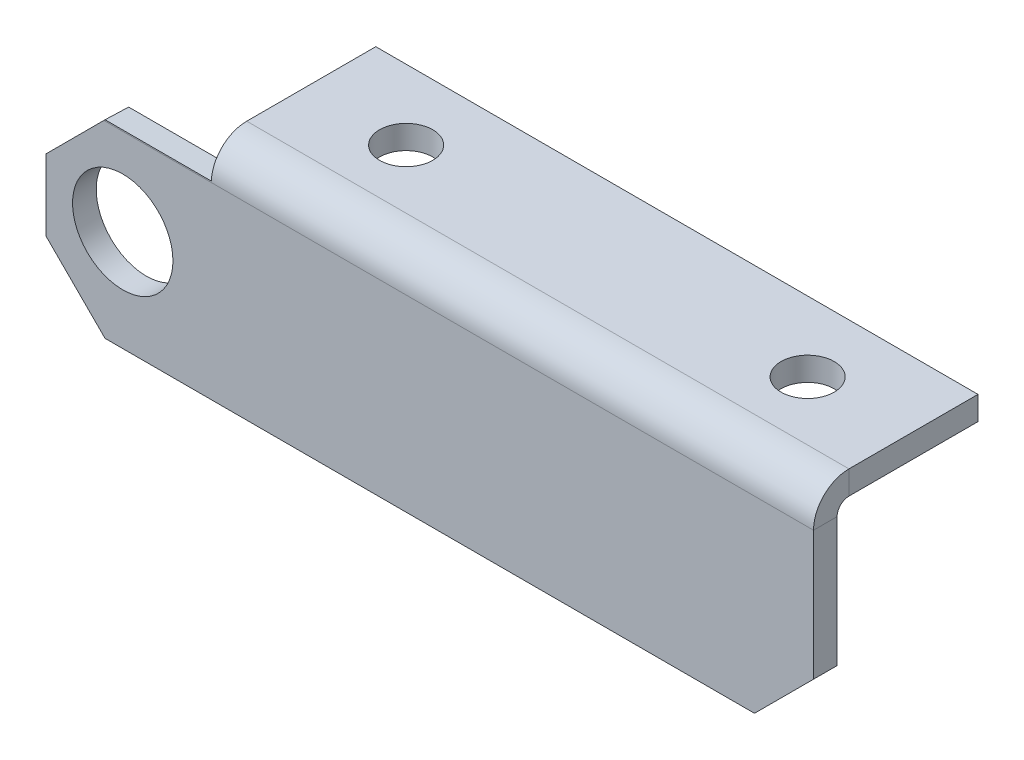
ISO-10303-21;
HEADER;
FILE_DESCRIPTION(('STEP AP214'),'2;1');
FILE_NAME('part.step','',(''),(''),'','','');
FILE_SCHEMA(('AUTOMOTIVE_DESIGN { 1 0 10303 214 1 1 1 1 }'));
ENDSEC;
DATA;
#1=APPLICATION_CONTEXT('core data for automotive mechanical design processes');
#2=APPLICATION_PROTOCOL_DEFINITION('international standard','automotive_design',2000,#1);
#3=PRODUCT_CONTEXT('',#1,'mechanical');
#4=PRODUCT('Part','Part','',(#3));
#5=PRODUCT_RELATED_PRODUCT_CATEGORY('part','',(#4));
#6=PRODUCT_DEFINITION_FORMATION('','',#4);
#7=PRODUCT_DEFINITION_CONTEXT('part definition',#1,'design');
#8=PRODUCT_DEFINITION('design','',#6,#7);
#9=PRODUCT_DEFINITION_SHAPE('','',#8);
#10=(LENGTH_UNIT() NAMED_UNIT(*) SI_UNIT(.MILLI.,.METRE.));
#11=(NAMED_UNIT(*) PLANE_ANGLE_UNIT() SI_UNIT($,.RADIAN.));
#12=(NAMED_UNIT(*) SI_UNIT($,.STERADIAN.) SOLID_ANGLE_UNIT());
#13=UNCERTAINTY_MEASURE_WITH_UNIT(LENGTH_MEASURE(1.E-05),#10,'distance_accuracy_value','');
#14=(GEOMETRIC_REPRESENTATION_CONTEXT(3) GLOBAL_UNCERTAINTY_ASSIGNED_CONTEXT((#13)) GLOBAL_UNIT_ASSIGNED_CONTEXT((#10,
#11,#12)) REPRESENTATION_CONTEXT('',''));
#15=CARTESIAN_POINT('',(0.,0.,0.));
#16=DIRECTION('',(0.,0.,1.));
#17=DIRECTION('',(1.,0.,0.));
#18=AXIS2_PLACEMENT_3D('',#15,#16,#17);
#19=CARTESIAN_POINT('',(0.,18.9292036732052,18.0707963267949));
#20=DIRECTION('',(0.,1.,0.));
#21=DIRECTION('',(1.,0.,0.));
#22=AXIS2_PLACEMENT_3D('',#19,#20,#21);
#23=PLANE('',#22);
#24=CARTESIAN_POINT('',(22.5,18.9292036732052,-6.00000000000007));
#25=DIRECTION('',(0.,-1.,0.));
#26=DIRECTION('',(0.,0.,-1.));
#27=AXIS2_PLACEMENT_3D('',#24,#25,#26);
#28=CIRCLE('',#27,2.25);
#29=CARTESIAN_POINT('',(22.5,18.9292036732052,-8.25000000000007));
#30=VERTEX_POINT('',#29);
#31=EDGE_CURVE('E475',#30,#30,#28,.T.);
#32=ORIENTED_EDGE('',*,*,#31,.T.);
#33=EDGE_LOOP('',(#32));
#34=FACE_BOUND('',#33,.T.);
#35=CARTESIAN_POINT('',(56.5000000000001,18.9292036732052,-5.99999999999995));
#36=DIRECTION('',(0.,-1.,0.));
#37=DIRECTION('',(0.,0.,-1.));
#38=AXIS2_PLACEMENT_3D('',#35,#36,#37);
#39=CIRCLE('',#38,2.25);
#40=CARTESIAN_POINT('',(56.5000000000001,18.9292036732051,-8.24999999999995));
#41=VERTEX_POINT('',#40);
#42=EDGE_CURVE('E470',#41,#41,#39,.T.);
#43=ORIENTED_EDGE('',*,*,#42,.T.);
#44=EDGE_LOOP('',(#43));
#45=FACE_BOUND('',#44,.T.);
#46=DIRECTION('',(0.,0.,1.));
#47=VECTOR('',#46,1.);
#48=CARTESIAN_POINT('',(14.,18.9292036732051,-11.9292036732051));
#49=LINE('',#48,#47);
#50=CARTESIAN_POINT('',(14.,18.9292036732051,-11.9292036732051));
#51=VERTEX_POINT('',#50);
#52=CARTESIAN_POINT('',(14.,18.9292036732051,-1.00000000000001));
#53=VERTEX_POINT('',#52);
#54=EDGE_CURVE('E198',#51,#53,#49,.T.);
#55=ORIENTED_EDGE('',*,*,#54,.T.);
#56=DIRECTION('',(1.,0.,0.));
#57=VECTOR('',#56,1.);
#58=CARTESIAN_POINT('',(0.,18.9292036732051,-1.00000000000001));
#59=LINE('',#58,#57);
#60=CARTESIAN_POINT('',(65.0000000000001,18.9292036732052,-0.99999999999989));
#61=VERTEX_POINT('',#60);
#62=EDGE_CURVE('E211',#53,#61,#59,.T.);
#63=ORIENTED_EDGE('',*,*,#62,.T.);
#64=DIRECTION('',(0.,0.,-1.));
#65=VECTOR('',#64,1.);
#66=CARTESIAN_POINT('',(65.0000000000001,18.9292036732052,18.0707963267949));
#67=LINE('',#66,#65);
#68=CARTESIAN_POINT('',(65.0000000000001,18.9292036732051,-11.929203673205));
#69=VERTEX_POINT('',#68);
#70=EDGE_CURVE('E194',#61,#69,#67,.T.);
#71=ORIENTED_EDGE('',*,*,#70,.T.);
#72=DIRECTION('',(-1.,0.,0.));
#73=VECTOR('',#72,1.);
#74=CARTESIAN_POINT('',(65.0000000000001,18.9292036732051,-11.929203673205));
#75=LINE('',#74,#73);
#76=EDGE_CURVE('E196',#69,#51,#75,.T.);
#77=ORIENTED_EDGE('',*,*,#76,.T.);
#78=EDGE_LOOP('',(#55,#63,#71,#77));
#79=FACE_BOUND('',#78,.T.);
#80=ADVANCED_FACE('F32',(#34,#45,#79),#23,.T.);
#81=CARTESIAN_POINT('',(65.0000000000001,18.9292036732052,18.0707963267949));
#82=DIRECTION('',(-1.,0.,0.));
#83=DIRECTION('',(0.,1.,0.));
#84=AXIS2_PLACEMENT_3D('',#81,#82,#83);
#85=PLANE('',#84);
#86=DIRECTION('',(0.,1.,0.));
#87=VECTOR('',#86,1.);
#88=CARTESIAN_POINT('',(65.0000000000001,18.9292036732052,-0.99999999999989));
#89=LINE('',#88,#87);
#90=CARTESIAN_POINT('',(65.,16.9292036732052,-0.999999999999918));
#91=VERTEX_POINT('',#90);
#92=EDGE_CURVE('E207',#91,#61,#89,.T.);
#93=ORIENTED_EDGE('',*,*,#92,.F.);
#94=DIRECTION('',(0.,0.,-1.));
#95=VECTOR('',#94,1.);
#96=CARTESIAN_POINT('',(65.,16.9292036732052,18.070796326795));
#97=LINE('',#96,#95);
#98=CARTESIAN_POINT('',(65.0000000000001,16.9292036732051,-11.929203673205));
#99=VERTEX_POINT('',#98);
#100=EDGE_CURVE('E188',#91,#99,#97,.T.);
#101=ORIENTED_EDGE('',*,*,#100,.T.);
#102=DIRECTION('',(0.,-1.,0.));
#103=VECTOR('',#102,1.);
#104=CARTESIAN_POINT('',(65.0000000000001,18.9292036732051,-11.929203673205));
#105=LINE('',#104,#103);
#106=EDGE_CURVE('E204',#69,#99,#105,.T.);
#107=ORIENTED_EDGE('',*,*,#106,.F.);
#108=ORIENTED_EDGE('',*,*,#70,.F.);
#109=EDGE_LOOP('',(#93,#101,#107,#108));
#110=FACE_BOUND('',#109,.T.);
#111=ADVANCED_FACE('F34',(#110),#85,.F.);
#112=CARTESIAN_POINT('',(65.0000000000001,18.9292036732051,-11.929203673205));
#113=DIRECTION('',(0.,0.,1.));
#114=DIRECTION('',(1.,0.,0.));
#115=AXIS2_PLACEMENT_3D('',#112,#113,#114);
#116=PLANE('',#115);
#117=DIRECTION('',(-1.,0.,0.));
#118=VECTOR('',#117,1.);
#119=CARTESIAN_POINT('',(65.0000000000001,16.9292036732051,-11.929203673205));
#120=LINE('',#119,#118);
#121=CARTESIAN_POINT('',(14.,16.9292036732051,-11.9292036732051));
#122=VERTEX_POINT('',#121);
#123=EDGE_CURVE('E190',#99,#122,#120,.T.);
#124=ORIENTED_EDGE('',*,*,#123,.T.);
#125=DIRECTION('',(0.,-1.,0.));
#126=VECTOR('',#125,1.);
#127=CARTESIAN_POINT('',(14.,18.9292036732051,-11.9292036732051));
#128=LINE('',#127,#126);
#129=EDGE_CURVE('E201',#51,#122,#128,.T.);
#130=ORIENTED_EDGE('',*,*,#129,.F.);
#131=ORIENTED_EDGE('',*,*,#76,.F.);
#132=ORIENTED_EDGE('',*,*,#106,.T.);
#133=EDGE_LOOP('',(#124,#130,#131,#132));
#134=FACE_BOUND('',#133,.T.);
#135=ADVANCED_FACE('F263',(#134),#116,.F.);
#136=CARTESIAN_POINT('',(14.,18.9292036732051,-11.9292036732051));
#137=DIRECTION('',(1.,0.,0.));
#138=DIRECTION('',(0.,0.,-1.));
#139=AXIS2_PLACEMENT_3D('',#136,#137,#138);
#140=PLANE('',#139);
#141=DIRECTION('',(0.,-1.,0.));
#142=VECTOR('',#141,1.);
#143=CARTESIAN_POINT('',(14.,18.9292036732051,-1.00000000000001));
#144=LINE('',#143,#142);
#145=CARTESIAN_POINT('',(14.,16.9292036732051,-1.00000000000004));
#146=VERTEX_POINT('',#145);
#147=EDGE_CURVE('E154',#53,#146,#144,.T.);
#148=ORIENTED_EDGE('',*,*,#147,.F.);
#149=ORIENTED_EDGE('',*,*,#54,.F.);
#150=ORIENTED_EDGE('',*,*,#129,.T.);
#151=DIRECTION('',(0.,0.,1.));
#152=VECTOR('',#151,1.);
#153=CARTESIAN_POINT('',(14.,16.9292036732051,-11.9292036732051));
#154=LINE('',#153,#152);
#155=EDGE_CURVE('E192',#122,#146,#154,.T.);
#156=ORIENTED_EDGE('',*,*,#155,.T.);
#157=EDGE_LOOP('',(#148,#149,#150,#156));
#158=FACE_BOUND('',#157,.T.);
#159=ADVANCED_FACE('F307',(#158),#140,.F.);
#160=CARTESIAN_POINT('',(0.,16.9292036732052,18.0707963267949));
#161=DIRECTION('',(0.,1.,0.));
#162=DIRECTION('',(1.,0.,0.));
#163=AXIS2_PLACEMENT_3D('',#160,#161,#162);
#164=PLANE('',#163);
#165=CARTESIAN_POINT('',(22.5,16.9292036732051,-6.00000000000007));
#166=DIRECTION('',(0.,-1.,0.));
#167=DIRECTION('',(0.,0.,-1.));
#168=AXIS2_PLACEMENT_3D('',#165,#166,#167);
#169=CIRCLE('',#168,2.25);
#170=CARTESIAN_POINT('',(22.5,16.9292036732051,-8.25000000000007));
#171=VERTEX_POINT('',#170);
#172=EDGE_CURVE('E479',#171,#171,#169,.T.);
#173=ORIENTED_EDGE('',*,*,#172,.F.);
#174=EDGE_LOOP('',(#173));
#175=FACE_BOUND('',#174,.T.);
#176=CARTESIAN_POINT('',(56.5000000000001,16.9292036732051,-5.99999999999998));
#177=DIRECTION('',(0.,-1.,0.));
#178=DIRECTION('',(0.,0.,-1.));
#179=AXIS2_PLACEMENT_3D('',#176,#177,#178);
#180=CIRCLE('',#179,2.25);
#181=CARTESIAN_POINT('',(56.5000000000001,16.9292036732051,-8.24999999999998));
#182=VERTEX_POINT('',#181);
#183=EDGE_CURVE('E473',#182,#182,#180,.T.);
#184=ORIENTED_EDGE('',*,*,#183,.F.);
#185=EDGE_LOOP('',(#184));
#186=FACE_BOUND('',#185,.T.);
#187=DIRECTION('',(1.,0.,0.));
#188=VECTOR('',#187,1.);
#189=CARTESIAN_POINT('',(0.,16.9292036732051,-1.));
#190=LINE('',#189,#188);
#191=EDGE_CURVE('E213',#146,#91,#190,.T.);
#192=ORIENTED_EDGE('',*,*,#191,.F.);
#193=ORIENTED_EDGE('',*,*,#155,.F.);
#194=ORIENTED_EDGE('',*,*,#123,.F.);
#195=ORIENTED_EDGE('',*,*,#100,.F.);
#196=EDGE_LOOP('',(#192,#193,#194,#195));
#197=FACE_BOUND('',#196,.T.);
#198=ADVANCED_FACE('F256',(#175,#186,#197),#164,.F.);
#199=CARTESIAN_POINT('',(0.,16.,2.));
#200=DIRECTION('',(1.,0.,0.));
#201=DIRECTION('',(0.,1.,0.));
#202=AXIS2_PLACEMENT_3D('',#199,#200,#201);
#203=PLANE('',#202);
#204=DIRECTION('',(0.,-1.,0.));
#205=VECTOR('',#204,1.);
#206=CARTESIAN_POINT('',(0.,16.,2.));
#207=LINE('',#206,#205);
#208=CARTESIAN_POINT('',(0.,11.0323083293317,2.00000000000009));
#209=VERTEX_POINT('',#208);
#210=CARTESIAN_POINT('',(0.,5.00000000000004,2.00000000000009));
#211=VERTEX_POINT('',#210);
#212=EDGE_CURVE('E172',#209,#211,#207,.T.);
#213=ORIENTED_EDGE('',*,*,#212,.F.);
#214=DIRECTION('',(0.,-0.0353907713673031,-0.999373550431483));
#215=VECTOR('',#214,1.);
#216=CARTESIAN_POINT('',(0.,10.967726692415,0.176327407268084));
#217=LINE('',#216,#215);
#218=CARTESIAN_POINT('',(0.,10.9614824177354,0.));
#219=VERTEX_POINT('',#218);
#220=EDGE_CURVE('E225',#209,#219,#217,.T.);
#221=ORIENTED_EDGE('',*,*,#220,.T.);
#222=DIRECTION('',(0.,-1.,0.));
#223=VECTOR('',#222,1.);
#224=CARTESIAN_POINT('',(0.,16.,0.));
#225=LINE('',#224,#223);
#226=CARTESIAN_POINT('',(0.,5.00000000000005,0.));
#227=VERTEX_POINT('',#226);
#228=EDGE_CURVE('E139',#219,#227,#225,.T.);
#229=ORIENTED_EDGE('',*,*,#228,.T.);
#230=DIRECTION('',(0.,0.,1.));
#231=VECTOR('',#230,1.);
#232=CARTESIAN_POINT('',(0.,5.00000000000006,2.00000000000009));
#233=LINE('',#232,#231);
#234=EDGE_CURVE('E223',#227,#211,#233,.T.);
#235=ORIENTED_EDGE('',*,*,#234,.T.);
#236=EDGE_LOOP('',(#213,#221,#229,#235));
#237=FACE_BOUND('',#236,.T.);
#238=ADVANCED_FACE('F279',(#237),#203,.F.);
#239=CARTESIAN_POINT('',(65.0000000000001,0.,2.));
#240=DIRECTION('',(-1.,0.,0.));
#241=DIRECTION('',(0.,0.,1.));
#242=AXIS2_PLACEMENT_3D('',#239,#240,#241);
#243=PLANE('',#242);
#244=DIRECTION('',(0.,1.,0.));
#245=VECTOR('',#244,1.);
#246=CARTESIAN_POINT('',(65.0000000000001,0.,2.));
#247=LINE('',#246,#245);
#248=CARTESIAN_POINT('',(65.0000000000001,5.00000000000001,2.));
#249=VERTEX_POINT('',#248);
#250=CARTESIAN_POINT('',(65.0000000000001,15.9292036732051,2.00000000000009));
#251=VERTEX_POINT('',#250);
#252=EDGE_CURVE('E177',#249,#251,#247,.T.);
#253=ORIENTED_EDGE('',*,*,#252,.F.);
#254=DIRECTION('',(0.,0.,-1.));
#255=VECTOR('',#254,1.);
#256=CARTESIAN_POINT('',(65.0000000000001,5.00000000000001,2.));
#257=LINE('',#256,#255);
#258=CARTESIAN_POINT('',(65.0000000000001,5.,0.));
#259=VERTEX_POINT('',#258);
#260=EDGE_CURVE('E235',#249,#259,#257,.T.);
#261=ORIENTED_EDGE('',*,*,#260,.T.);
#262=DIRECTION('',(0.,1.,0.));
#263=VECTOR('',#262,1.);
#264=CARTESIAN_POINT('',(65.0000000000001,0.,0.));
#265=LINE('',#264,#263);
#266=CARTESIAN_POINT('',(65.0000000000001,15.9292036732052,0.));
#267=VERTEX_POINT('',#266);
#268=EDGE_CURVE('E170',#259,#267,#265,.T.);
#269=ORIENTED_EDGE('',*,*,#268,.T.);
#270=DIRECTION('',(0.,0.,1.));
#271=VECTOR('',#270,1.);
#272=CARTESIAN_POINT('',(65.0000000000001,15.9292036732051,2.00000000000009));
#273=LINE('',#272,#271);
#274=EDGE_CURVE('E182',#267,#251,#273,.T.);
#275=ORIENTED_EDGE('',*,*,#274,.T.);
#276=EDGE_LOOP('',(#253,#261,#269,#275));
#277=FACE_BOUND('',#276,.T.);
#278=ADVANCED_FACE('F241',(#277),#243,.F.);
#279=CARTESIAN_POINT('',(0.,0.,0.));
#280=DIRECTION('',(0.,0.,1.));
#281=DIRECTION('',(1.,0.,0.));
#282=AXIS2_PLACEMENT_3D('',#279,#280,#281);
#283=PLANE('',#282);
#284=CARTESIAN_POINT('',(6.50000000000001,8.5592036732051,0.));
#285=DIRECTION('',(0.,0.,1.));
#286=DIRECTION('',(1.,0.,0.));
#287=AXIS2_PLACEMENT_3D('',#284,#285,#286);
#288=CIRCLE('',#287,4.25);
#289=CARTESIAN_POINT('',(10.75,8.5592036732051,0.));
#290=VERTEX_POINT('',#289);
#291=EDGE_CURVE('E150',#290,#290,#288,.T.);
#292=ORIENTED_EDGE('',*,*,#291,.T.);
#293=EDGE_LOOP('',(#292));
#294=FACE_BOUND('',#293,.T.);
#295=ORIENTED_EDGE('',*,*,#268,.F.);
#296=DIRECTION('',(0.707106781186549,0.707106781186547,0.));
#297=VECTOR('',#296,1.);
#298=CARTESIAN_POINT('',(65.0000000000001,5.00000000000001,0.));
#299=LINE('',#298,#297);
#300=CARTESIAN_POINT('',(60.0000000000001,0.,0.));
#301=VERTEX_POINT('',#300);
#302=EDGE_CURVE('E54',#259,#301,#299,.F.);
#303=ORIENTED_EDGE('',*,*,#302,.T.);
#304=DIRECTION('',(1.,0.,0.));
#305=VECTOR('',#304,1.);
#306=CARTESIAN_POINT('',(0.,0.,0.));
#307=LINE('',#306,#305);
#308=CARTESIAN_POINT('',(5.00000000000009,0.,0.));
#309=VERTEX_POINT('',#308);
#310=EDGE_CURVE('E168',#309,#301,#307,.T.);
#311=ORIENTED_EDGE('',*,*,#310,.F.);
#312=DIRECTION('',(0.707106781186552,-0.707106781186544,0.));
#313=VECTOR('',#312,1.);
#314=CARTESIAN_POINT('',(5.00000000000009,0.,0.));
#315=LINE('',#314,#313);
#316=EDGE_CURVE('E227',#309,#227,#315,.F.);
#317=ORIENTED_EDGE('',*,*,#316,.T.);
#318=ORIENTED_EDGE('',*,*,#228,.F.);
#319=DIRECTION('',(0.706885193723847,0.707328299231693,0.));
#320=VECTOR('',#319,1.);
#321=CARTESIAN_POINT('',(5.01768428999612,15.9823120042595,0.));
#322=LINE('',#321,#320);
#323=CARTESIAN_POINT('',(4.96460922863278,15.9292036732051,0.));
#324=VERTEX_POINT('',#323);
#325=EDGE_CURVE('E229',#219,#324,#322,.T.);
#326=ORIENTED_EDGE('',*,*,#325,.T.);
#327=DIRECTION('',(1.,0.,0.));
#328=VECTOR('',#327,1.);
#329=CARTESIAN_POINT('',(0.,15.9292036732051,0.));
#330=LINE('',#329,#328);
#331=EDGE_CURVE('E179',#324,#267,#330,.T.);
#332=ORIENTED_EDGE('',*,*,#331,.T.);
#333=EDGE_LOOP('',(#295,#303,#311,#317,#318,#326,#332));
#334=FACE_BOUND('',#333,.T.);
#335=ADVANCED_FACE('F244',(#294,#334),#283,.F.);
#336=CARTESIAN_POINT('',(0.,0.,2.));
#337=DIRECTION('',(0.,1.,0.));
#338=DIRECTION('',(0.,0.,1.));
#339=AXIS2_PLACEMENT_3D('',#336,#337,#338);
#340=PLANE('',#339);
#341=ORIENTED_EDGE('',*,*,#310,.T.);
#342=DIRECTION('',(0.,0.,1.));
#343=VECTOR('',#342,1.);
#344=CARTESIAN_POINT('',(60.0000000000001,0.,2.));
#345=LINE('',#344,#343);
#346=CARTESIAN_POINT('',(60.0000000000001,0.,2.));
#347=VERTEX_POINT('',#346);
#348=EDGE_CURVE('E40',#301,#347,#345,.T.);
#349=ORIENTED_EDGE('',*,*,#348,.T.);
#350=DIRECTION('',(1.,0.,0.));
#351=VECTOR('',#350,1.);
#352=CARTESIAN_POINT('',(0.,0.,2.));
#353=LINE('',#352,#351);
#354=CARTESIAN_POINT('',(5.00000000000009,0.,2.));
#355=VERTEX_POINT('',#354);
#356=EDGE_CURVE('E175',#355,#347,#353,.T.);
#357=ORIENTED_EDGE('',*,*,#356,.F.);
#358=DIRECTION('',(0.,0.,-1.));
#359=VECTOR('',#358,1.);
#360=CARTESIAN_POINT('',(5.00000000000009,0.,2.));
#361=LINE('',#360,#359);
#362=EDGE_CURVE('E232',#355,#309,#361,.T.);
#363=ORIENTED_EDGE('',*,*,#362,.T.);
#364=EDGE_LOOP('',(#341,#349,#357,#363));
#365=FACE_BOUND('',#364,.T.);
#366=ADVANCED_FACE('F285',(#365),#340,.F.);
#367=CARTESIAN_POINT('',(0.,0.,2.));
#368=DIRECTION('',(0.,0.,1.));
#369=DIRECTION('',(1.,0.,0.));
#370=AXIS2_PLACEMENT_3D('',#367,#368,#369);
#371=PLANE('',#370);
#372=CARTESIAN_POINT('',(6.50000000000001,8.55920367320512,2.00000000000009));
#373=DIRECTION('',(0.,0.,1.));
#374=DIRECTION('',(1.,0.,0.));
#375=AXIS2_PLACEMENT_3D('',#372,#373,#374);
#376=CIRCLE('',#375,4.25);
#377=CARTESIAN_POINT('',(10.75,8.55920367320512,2.00000000000008));
#378=VERTEX_POINT('',#377);
#379=EDGE_CURVE('E477',#378,#378,#376,.T.);
#380=ORIENTED_EDGE('',*,*,#379,.F.);
#381=EDGE_LOOP('',(#380));
#382=FACE_BOUND('',#381,.T.);
#383=ORIENTED_EDGE('',*,*,#356,.T.);
#384=DIRECTION('',(-0.707106781186549,-0.707106781186547,0.));
#385=VECTOR('',#384,1.);
#386=CARTESIAN_POINT('',(29.9999999999999,-30.,2.00000000000009));
#387=LINE('',#386,#385);
#388=EDGE_CURVE('E11',#347,#249,#387,.F.);
#389=ORIENTED_EDGE('',*,*,#388,.T.);
#390=ORIENTED_EDGE('',*,*,#252,.T.);
#391=DIRECTION('',(1.,0.,0.));
#392=VECTOR('',#391,1.);
#393=CARTESIAN_POINT('',(0.,15.9292036732051,2.));
#394=LINE('',#393,#392);
#395=CARTESIAN_POINT('',(4.89382768589818,15.9292036732051,2.));
#396=VERTEX_POINT('',#395);
#397=EDGE_CURVE('E185',#396,#251,#394,.T.);
#398=ORIENTED_EDGE('',*,*,#397,.F.);
#399=DIRECTION('',(-0.706885193723847,-0.707328299231693,0.));
#400=VECTOR('',#399,1.);
#401=CARTESIAN_POINT('',(-5.51615308161043,5.51269748989264,2.));
#402=LINE('',#401,#400);
#403=EDGE_CURVE('E221',#396,#209,#402,.T.);
#404=ORIENTED_EDGE('',*,*,#403,.T.);
#405=ORIENTED_EDGE('',*,*,#212,.T.);
#406=DIRECTION('',(-0.707106781186552,0.707106781186544,0.));
#407=VECTOR('',#406,1.);
#408=CARTESIAN_POINT('',(2.50000000000003,2.50000000000006,2.));
#409=LINE('',#408,#407);
#410=EDGE_CURVE('E219',#211,#355,#409,.F.);
#411=ORIENTED_EDGE('',*,*,#410,.T.);
#412=EDGE_LOOP('',(#383,#389,#390,#398,#404,#405,#411));
#413=FACE_BOUND('',#412,.T.);
#414=ADVANCED_FACE('F273',(#382,#413),#371,.T.);
#415=CARTESIAN_POINT('',(14.,15.9292036732051,-1.));
#416=DIRECTION('',(-1.,0.,0.));
#417=DIRECTION('',(0.,0.,1.));
#418=AXIS2_PLACEMENT_3D('',#415,#416,#417);
#419=PLANE('',#418);
#420=ORIENTED_EDGE('',*,*,#147,.T.);
#421=CARTESIAN_POINT('',(14.,15.9292036732051,-1.));
#422=DIRECTION('',(1.,0.,0.));
#423=DIRECTION('',(0.,1.,0.));
#424=AXIS2_PLACEMENT_3D('',#421,#422,#423);
#425=CIRCLE('',#424,1.);
#426=CARTESIAN_POINT('',(14.,15.9645944445724,-0.000626449568510989));
#427=VERTEX_POINT('',#426);
#428=EDGE_CURVE('E147',#146,#427,#425,.T.);
#429=ORIENTED_EDGE('',*,*,#428,.T.);
#430=DIRECTION('',(0.,0.0353907713673052,0.999373550431483));
#431=VECTOR('',#430,1.);
#432=CARTESIAN_POINT('',(14.,15.9999852159397,0.998747100862965));
#433=LINE('',#432,#431);
#434=CARTESIAN_POINT('',(14.,16.035375987307,1.99812065129445));
#435=VERTEX_POINT('',#434);
#436=EDGE_CURVE('E127',#427,#435,#433,.T.);
#437=ORIENTED_EDGE('',*,*,#436,.T.);
#438=CARTESIAN_POINT('',(14.,15.9292036732051,-1.));
#439=DIRECTION('',(1.,0.,0.));
#440=DIRECTION('',(0.,1.,0.));
#441=AXIS2_PLACEMENT_3D('',#438,#439,#440);
#442=CIRCLE('',#441,3.);
#443=EDGE_CURVE('E162',#53,#435,#442,.T.);
#444=ORIENTED_EDGE('',*,*,#443,.F.);
#445=EDGE_LOOP('',(#420,#429,#437,#444));
#446=FACE_BOUND('',#445,.T.);
#447=ADVANCED_FACE('F153',(#446),#419,.T.);
#448=CARTESIAN_POINT('',(7.00000000000001,15.9999852159397,0.998747100862965));
#449=DIRECTION('',(0.,0.999373550431483,-0.0353907713673031));
#450=DIRECTION('',(-1.,0.,0.));
#451=AXIS2_PLACEMENT_3D('',#448,#449,#450);
#452=PLANE('',#451);
#453=DIRECTION('',(1.,0.,0.));
#454=VECTOR('',#453,1.);
#455=CARTESIAN_POINT('',(-57.6170370791756,15.9645944445724,-0.000626449568469356));
#456=LINE('',#455,#454);
#457=CARTESIAN_POINT('',(5.00000000000008,15.9645944445724,-0.000626449568510989));
#458=VERTEX_POINT('',#457);
#459=EDGE_CURVE('E131',#427,#458,#456,.F.);
#460=ORIENTED_EDGE('',*,*,#459,.T.);
#461=DIRECTION('',(0.,0.0353907713673032,0.999373550431483));
#462=VECTOR('',#461,1.);
#463=CARTESIAN_POINT('',(5.00000000000009,16.035375987307,1.99812065129445));
#464=LINE('',#463,#462);
#465=CARTESIAN_POINT('',(5.00000000000007,16.035375987307,1.99812065129445));
#466=VERTEX_POINT('',#465);
#467=EDGE_CURVE('E215',#458,#466,#464,.T.);
#468=ORIENTED_EDGE('',*,*,#467,.T.);
#469=DIRECTION('',(1.,0.,0.));
#470=VECTOR('',#469,1.);
#471=CARTESIAN_POINT('',(-57.6170370791756,16.035375987307,1.9981206512945));
#472=LINE('',#471,#470);
#473=EDGE_CURVE('E134',#435,#466,#472,.F.);
#474=ORIENTED_EDGE('',*,*,#473,.F.);
#475=ORIENTED_EDGE('',*,*,#436,.F.);
#476=EDGE_LOOP('',(#460,#468,#474,#475));
#477=FACE_BOUND('',#476,.T.);
#478=ADVANCED_FACE('F129',(#477),#452,.T.);
#479=CARTESIAN_POINT('',(65.0000000000001,15.9292036732052,-0.999999999999918));
#480=DIRECTION('',(1.,0.,0.));
#481=DIRECTION('',(0.,0.,-1.));
#482=AXIS2_PLACEMENT_3D('',#479,#480,#481);
#483=PLANE('',#482);
#484=CARTESIAN_POINT('',(65.0000000000001,15.9292036732052,-0.999999999999918));
#485=DIRECTION('',(1.,0.,0.));
#486=DIRECTION('',(0.,1.,0.));
#487=AXIS2_PLACEMENT_3D('',#484,#485,#486);
#488=CIRCLE('',#487,1.);
#489=EDGE_CURVE('E155',#267,#91,#488,.F.);
#490=ORIENTED_EDGE('',*,*,#489,.T.);
#491=ORIENTED_EDGE('',*,*,#92,.T.);
#492=CARTESIAN_POINT('',(65.0000000000001,15.9292036732052,-0.999999999999918));
#493=DIRECTION('',(1.,0.,0.));
#494=DIRECTION('',(0.,1.,0.));
#495=AXIS2_PLACEMENT_3D('',#492,#493,#494);
#496=CIRCLE('',#495,3.);
#497=EDGE_CURVE('E140',#251,#61,#496,.F.);
#498=ORIENTED_EDGE('',*,*,#497,.F.);
#499=ORIENTED_EDGE('',*,*,#274,.F.);
#500=EDGE_LOOP('',(#490,#491,#498,#499));
#501=FACE_BOUND('',#500,.T.);
#502=ADVANCED_FACE('F251',(#501),#483,.T.);
#503=CARTESIAN_POINT('',(-57.6170370791756,15.9292036732051,-0.999999999999959));
#504=DIRECTION('',(1.,0.,0.));
#505=DIRECTION('',(0.,1.,0.));
#506=AXIS2_PLACEMENT_3D('',#503,#504,#505);
#507=CYLINDRICAL_SURFACE('',#506,3.);
#508=ORIENTED_EDGE('',*,*,#473,.T.);
#509=CARTESIAN_POINT('',(5.00000000000008,15.9292036732051,-1.));
#510=DIRECTION('',(-0.707106781186545,0.706663814448581,-0.0250250544252428));
#511=DIRECTION('',(0.707106781186552,0.706663814448574,-0.0250250544252426));
#512=AXIS2_PLACEMENT_3D('',#509,#510,#511);
#513=ELLIPSE('',#512,4.24264068711931,3.);
#514=EDGE_CURVE('E217',#466,#396,#513,.F.);
#515=ORIENTED_EDGE('',*,*,#514,.T.);
#516=ORIENTED_EDGE('',*,*,#397,.T.);
#517=ORIENTED_EDGE('',*,*,#497,.T.);
#518=ORIENTED_EDGE('',*,*,#62,.F.);
#519=ORIENTED_EDGE('',*,*,#443,.T.);
#520=EDGE_LOOP('',(#508,#515,#516,#517,#518,#519));
#521=FACE_BOUND('',#520,.T.);
#522=ADVANCED_FACE('F269',(#521),#507,.T.);
#523=CARTESIAN_POINT('',(-57.6170370791756,15.9292036732051,-0.999999999999959));
#524=DIRECTION('',(1.,0.,0.));
#525=DIRECTION('',(0.,1.,0.));
#526=AXIS2_PLACEMENT_3D('',#523,#524,#525);
#527=CYLINDRICAL_SURFACE('',#526,1.);
#528=ORIENTED_EDGE('',*,*,#331,.F.);
#529=CARTESIAN_POINT('',(5.00000000000008,15.9292036732051,-1.));
#530=DIRECTION('',(-0.707106781186545,0.706663814448581,-0.0250250544252428));
#531=DIRECTION('',(0.707106781186552,0.706663814448574,-0.0250250544252426));
#532=AXIS2_PLACEMENT_3D('',#529,#530,#531);
#533=ELLIPSE('',#532,1.4142135623731,1.);
#534=EDGE_CURVE('E149',#324,#458,#533,.T.);
#535=ORIENTED_EDGE('',*,*,#534,.T.);
#536=ORIENTED_EDGE('',*,*,#459,.F.);
#537=ORIENTED_EDGE('',*,*,#428,.F.);
#538=ORIENTED_EDGE('',*,*,#191,.T.);
#539=ORIENTED_EDGE('',*,*,#489,.F.);
#540=EDGE_LOOP('',(#528,#535,#536,#537,#538,#539));
#541=FACE_BOUND('',#540,.T.);
#542=ADVANCED_FACE('F145',(#541),#527,.F.);
#543=CARTESIAN_POINT('',(5.00000000000009,15.9999852159397,0.998747100862965));
#544=DIRECTION('',(-0.707106781186545,0.706663814448581,-0.0250250544252428));
#545=DIRECTION('',(-0.706885193723847,-0.707328299231693,0.));
#546=AXIS2_PLACEMENT_3D('',#543,#544,#545);
#547=PLANE('',#546);
#548=ORIENTED_EDGE('',*,*,#325,.F.);
#549=ORIENTED_EDGE('',*,*,#220,.F.);
#550=ORIENTED_EDGE('',*,*,#403,.F.);
#551=ORIENTED_EDGE('',*,*,#514,.F.);
#552=ORIENTED_EDGE('',*,*,#467,.F.);
#553=ORIENTED_EDGE('',*,*,#534,.F.);
#554=EDGE_LOOP('',(#548,#549,#550,#551,#552,#553));
#555=FACE_BOUND('',#554,.T.);
#556=ADVANCED_FACE('F277',(#555),#547,.T.);
#557=CARTESIAN_POINT('',(5.00000000000009,0.,2.));
#558=DIRECTION('',(0.707106781186544,0.707106781186552,0.));
#559=DIRECTION('',(-0.707106781186552,0.707106781186544,0.));
#560=AXIS2_PLACEMENT_3D('',#557,#558,#559);
#561=PLANE('',#560);
#562=ORIENTED_EDGE('',*,*,#410,.F.);
#563=ORIENTED_EDGE('',*,*,#234,.F.);
#564=ORIENTED_EDGE('',*,*,#316,.F.);
#565=ORIENTED_EDGE('',*,*,#362,.F.);
#566=EDGE_LOOP('',(#562,#563,#564,#565));
#567=FACE_BOUND('',#566,.T.);
#568=ADVANCED_FACE('F284',(#567),#561,.F.);
#569=CARTESIAN_POINT('',(6.50000000000001,8.55920367320512,-11.929203673205));
#570=DIRECTION('',(0.,0.,1.));
#571=DIRECTION('',(1.,0.,0.));
#572=AXIS2_PLACEMENT_3D('',#569,#570,#571);
#573=CYLINDRICAL_SURFACE('',#572,4.25);
#574=ORIENTED_EDGE('',*,*,#379,.T.);
#575=EDGE_LOOP('',(#574));
#576=FACE_BOUND('',#575,.T.);
#577=ORIENTED_EDGE('',*,*,#291,.F.);
#578=EDGE_LOOP('',(#577));
#579=FACE_BOUND('',#578,.T.);
#580=ADVANCED_FACE('F398',(#576,#579),#573,.F.);
#581=CARTESIAN_POINT('',(56.5000000000001,18.9292036732052,-5.99999999999995));
#582=DIRECTION('',(0.,-1.,0.));
#583=DIRECTION('',(0.,0.,-1.));
#584=AXIS2_PLACEMENT_3D('',#581,#582,#583);
#585=CYLINDRICAL_SURFACE('',#584,2.25);
#586=ORIENTED_EDGE('',*,*,#42,.F.);
#587=EDGE_LOOP('',(#586));
#588=FACE_BOUND('',#587,.T.);
#589=ORIENTED_EDGE('',*,*,#183,.T.);
#590=EDGE_LOOP('',(#589));
#591=FACE_BOUND('',#590,.T.);
#592=ADVANCED_FACE('F293',(#588,#591),#585,.F.);
#593=CARTESIAN_POINT('',(22.5,18.9292036732052,-6.00000000000007));
#594=DIRECTION('',(0.,-1.,0.));
#595=DIRECTION('',(0.,0.,-1.));
#596=AXIS2_PLACEMENT_3D('',#593,#594,#595);
#597=CYLINDRICAL_SURFACE('',#596,2.25);
#598=ORIENTED_EDGE('',*,*,#31,.F.);
#599=EDGE_LOOP('',(#598));
#600=FACE_BOUND('',#599,.T.);
#601=ORIENTED_EDGE('',*,*,#172,.T.);
#602=EDGE_LOOP('',(#601));
#603=FACE_BOUND('',#602,.T.);
#604=ADVANCED_FACE('F288',(#600,#603),#597,.F.);
#605=CARTESIAN_POINT('',(65.0000000000001,5.00000000000001,2.));
#606=DIRECTION('',(-0.707106781186547,0.707106781186549,0.));
#607=DIRECTION('',(-0.707106781186549,-0.707106781186547,0.));
#608=AXIS2_PLACEMENT_3D('',#605,#606,#607);
#609=PLANE('',#608);
#610=ORIENTED_EDGE('',*,*,#388,.F.);
#611=ORIENTED_EDGE('',*,*,#348,.F.);
#612=ORIENTED_EDGE('',*,*,#302,.F.);
#613=ORIENTED_EDGE('',*,*,#260,.F.);
#614=EDGE_LOOP('',(#610,#611,#612,#613));
#615=FACE_BOUND('',#614,.T.);
#616=ADVANCED_FACE('F286',(#615),#609,.F.);
#617=CLOSED_SHELL('',(#80,#111,#135,#159,#198,#238,#278,#335,#366,#414,#447,#478,#502,#522,#542,
#556,#568,#580,#592,#604,#616));
#618=MANIFOLD_SOLID_BREP('B2',#617);
#619=ADVANCED_BREP_SHAPE_REPRESENTATION('',(#18,#618),#14);
#620=SHAPE_DEFINITION_REPRESENTATION(#9,#619);
ENDSEC;
END-ISO-10303-21;
